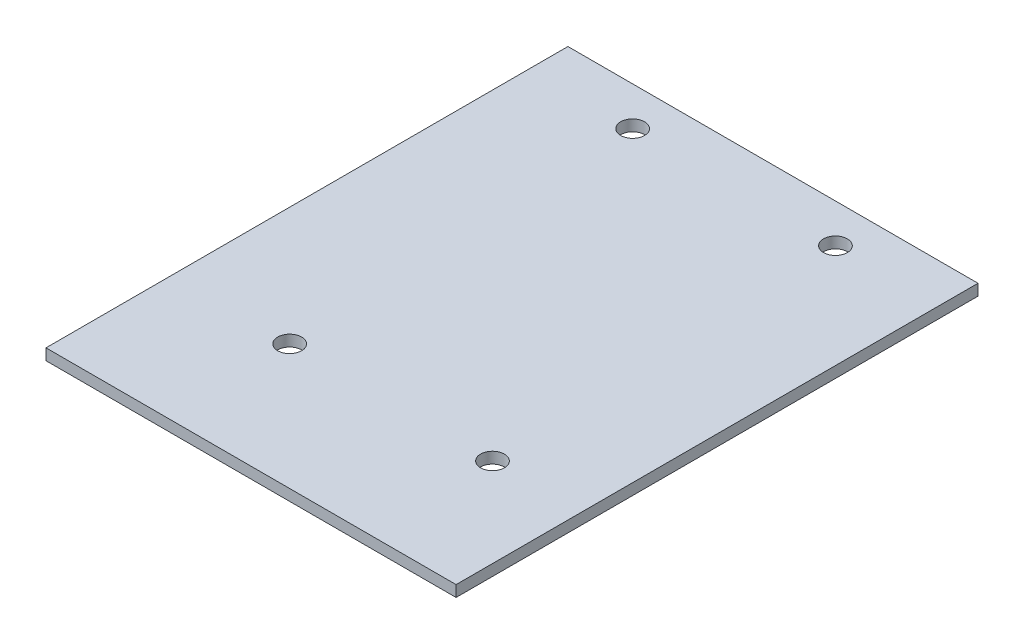
ISO-10303-21;
HEADER;
FILE_DESCRIPTION(('STEP AP214'),'2;1');
FILE_NAME('part.step','',(''),(''),'','','');
FILE_SCHEMA(('AUTOMOTIVE_DESIGN { 1 0 10303 214 1 1 1 1 }'));
ENDSEC;
DATA;
#1=APPLICATION_CONTEXT('core data for automotive mechanical design processes');
#2=APPLICATION_PROTOCOL_DEFINITION('international standard','automotive_design',2000,#1);
#3=PRODUCT_CONTEXT('',#1,'mechanical');
#4=PRODUCT('Part','Part','',(#3));
#5=PRODUCT_RELATED_PRODUCT_CATEGORY('part','',(#4));
#6=PRODUCT_DEFINITION_FORMATION('','',#4);
#7=PRODUCT_DEFINITION_CONTEXT('part definition',#1,'design');
#8=PRODUCT_DEFINITION('design','',#6,#7);
#9=PRODUCT_DEFINITION_SHAPE('','',#8);
#10=(LENGTH_UNIT() NAMED_UNIT(*) SI_UNIT(.MILLI.,.METRE.));
#11=(NAMED_UNIT(*) PLANE_ANGLE_UNIT() SI_UNIT($,.RADIAN.));
#12=(NAMED_UNIT(*) SI_UNIT($,.STERADIAN.) SOLID_ANGLE_UNIT());
#13=UNCERTAINTY_MEASURE_WITH_UNIT(LENGTH_MEASURE(1.E-05),#10,'distance_accuracy_value','');
#14=(GEOMETRIC_REPRESENTATION_CONTEXT(3) GLOBAL_UNCERTAINTY_ASSIGNED_CONTEXT((#13)) GLOBAL_UNIT_ASSIGNED_CONTEXT((#10,
#11,#12)) REPRESENTATION_CONTEXT('',''));
#15=CARTESIAN_POINT('',(0.,0.,0.));
#16=DIRECTION('',(0.,0.,1.));
#17=DIRECTION('',(1.,0.,0.));
#18=AXIS2_PLACEMENT_3D('',#15,#16,#17);
#19=CARTESIAN_POINT('',(0.,1.5,0.));
#20=DIRECTION('',(1.,0.,0.));
#21=DIRECTION('',(0.,0.,-1.));
#22=AXIS2_PLACEMENT_3D('',#19,#20,#21);
#23=PLANE('',#22);
#24=DIRECTION('',(0.,0.,1.));
#25=VECTOR('',#24,1.);
#26=CARTESIAN_POINT('',(0.,0.,0.));
#27=LINE('',#26,#25);
#28=CARTESIAN_POINT('',(0.,0.,-70.));
#29=VERTEX_POINT('',#28);
#30=CARTESIAN_POINT('',(0.,0.,0.));
#31=VERTEX_POINT('',#30);
#32=EDGE_CURVE('E96',#29,#31,#27,.T.);
#33=ORIENTED_EDGE('',*,*,#32,.T.);
#34=DIRECTION('',(0.,-1.,0.));
#35=VECTOR('',#34,1.);
#36=CARTESIAN_POINT('',(0.,1.5,0.));
#37=LINE('',#36,#35);
#38=CARTESIAN_POINT('',(0.,1.5,0.));
#39=VERTEX_POINT('',#38);
#40=EDGE_CURVE('E11',#39,#31,#37,.T.);
#41=ORIENTED_EDGE('',*,*,#40,.F.);
#42=DIRECTION('',(0.,0.,1.));
#43=VECTOR('',#42,1.);
#44=CARTESIAN_POINT('',(0.,1.5,0.));
#45=LINE('',#44,#43);
#46=CARTESIAN_POINT('',(0.,1.5,-70.));
#47=VERTEX_POINT('',#46);
#48=EDGE_CURVE('E84',#47,#39,#45,.T.);
#49=ORIENTED_EDGE('',*,*,#48,.F.);
#50=DIRECTION('',(0.,-1.,0.));
#51=VECTOR('',#50,1.);
#52=CARTESIAN_POINT('',(0.,1.5,-70.));
#53=LINE('',#52,#51);
#54=EDGE_CURVE('E92',#47,#29,#53,.T.);
#55=ORIENTED_EDGE('',*,*,#54,.T.);
#56=EDGE_LOOP('',(#33,#41,#49,#55));
#57=FACE_BOUND('',#56,.T.);
#58=ADVANCED_FACE('F33',(#57),#23,.F.);
#59=CARTESIAN_POINT('',(0.,1.5,0.));
#60=DIRECTION('',(0.,0.,-1.));
#61=DIRECTION('',(-1.,0.,0.));
#62=AXIS2_PLACEMENT_3D('',#59,#60,#61);
#63=PLANE('',#62);
#64=DIRECTION('',(1.,0.,0.));
#65=VECTOR('',#64,1.);
#66=CARTESIAN_POINT('',(0.,0.,0.));
#67=LINE('',#66,#65);
#68=CARTESIAN_POINT('',(55.,0.,0.));
#69=VERTEX_POINT('',#68);
#70=EDGE_CURVE('E88',#31,#69,#67,.T.);
#71=ORIENTED_EDGE('',*,*,#70,.T.);
#72=DIRECTION('',(0.,-1.,0.));
#73=VECTOR('',#72,1.);
#74=CARTESIAN_POINT('',(55.,1.5,0.));
#75=LINE('',#74,#73);
#76=CARTESIAN_POINT('',(55.,1.5,0.));
#77=VERTEX_POINT('',#76);
#78=EDGE_CURVE('E41',#77,#69,#75,.T.);
#79=ORIENTED_EDGE('',*,*,#78,.F.);
#80=DIRECTION('',(1.,0.,0.));
#81=VECTOR('',#80,1.);
#82=CARTESIAN_POINT('',(0.,1.5,0.));
#83=LINE('',#82,#81);
#84=EDGE_CURVE('E79',#39,#77,#83,.T.);
#85=ORIENTED_EDGE('',*,*,#84,.F.);
#86=ORIENTED_EDGE('',*,*,#40,.T.);
#87=EDGE_LOOP('',(#71,#79,#85,#86));
#88=FACE_BOUND('',#87,.T.);
#89=ADVANCED_FACE('F87',(#88),#63,.F.);
#90=CARTESIAN_POINT('',(55.,1.5,0.));
#91=DIRECTION('',(-1.,0.,0.));
#92=DIRECTION('',(0.,0.,1.));
#93=AXIS2_PLACEMENT_3D('',#90,#91,#92);
#94=PLANE('',#93);
#95=DIRECTION('',(0.,0.,-1.));
#96=VECTOR('',#95,1.);
#97=CARTESIAN_POINT('',(55.,0.,0.));
#98=LINE('',#97,#96);
#99=CARTESIAN_POINT('',(55.,0.,-70.));
#100=VERTEX_POINT('',#99);
#101=EDGE_CURVE('E66',#69,#100,#98,.T.);
#102=ORIENTED_EDGE('',*,*,#101,.T.);
#103=DIRECTION('',(0.,-1.,0.));
#104=VECTOR('',#103,1.);
#105=CARTESIAN_POINT('',(55.,1.5,-70.));
#106=LINE('',#105,#104);
#107=CARTESIAN_POINT('',(55.,1.5,-70.));
#108=VERTEX_POINT('',#107);
#109=EDGE_CURVE('E89',#108,#100,#106,.T.);
#110=ORIENTED_EDGE('',*,*,#109,.F.);
#111=DIRECTION('',(0.,0.,-1.));
#112=VECTOR('',#111,1.);
#113=CARTESIAN_POINT('',(55.,1.5,0.));
#114=LINE('',#113,#112);
#115=EDGE_CURVE('E82',#77,#108,#114,.T.);
#116=ORIENTED_EDGE('',*,*,#115,.F.);
#117=ORIENTED_EDGE('',*,*,#78,.T.);
#118=EDGE_LOOP('',(#102,#110,#116,#117));
#119=FACE_BOUND('',#118,.T.);
#120=ADVANCED_FACE('F90',(#119),#94,.F.);
#121=CARTESIAN_POINT('',(0.,1.5,-70.));
#122=DIRECTION('',(0.,0.,1.));
#123=DIRECTION('',(1.,0.,0.));
#124=AXIS2_PLACEMENT_3D('',#121,#122,#123);
#125=PLANE('',#124);
#126=DIRECTION('',(-1.,0.,0.));
#127=VECTOR('',#126,1.);
#128=CARTESIAN_POINT('',(0.,0.,-70.));
#129=LINE('',#128,#127);
#130=EDGE_CURVE('E72',#100,#29,#129,.T.);
#131=ORIENTED_EDGE('',*,*,#130,.T.);
#132=ORIENTED_EDGE('',*,*,#54,.F.);
#133=DIRECTION('',(-1.,0.,0.));
#134=VECTOR('',#133,1.);
#135=CARTESIAN_POINT('',(0.,1.5,-70.));
#136=LINE('',#135,#134);
#137=EDGE_CURVE('E49',#108,#47,#136,.T.);
#138=ORIENTED_EDGE('',*,*,#137,.F.);
#139=ORIENTED_EDGE('',*,*,#109,.T.);
#140=EDGE_LOOP('',(#131,#132,#138,#139));
#141=FACE_BOUND('',#140,.T.);
#142=ADVANCED_FACE('F104',(#141),#125,.F.);
#143=CARTESIAN_POINT('',(0.,1.5,0.));
#144=DIRECTION('',(0.,-1.,0.));
#145=DIRECTION('',(0.,0.,-1.));
#146=AXIS2_PLACEMENT_3D('',#143,#144,#145);
#147=PLANE('',#146);
#148=CARTESIAN_POINT('',(41.0808009190515,1.5,-64.8));
#149=DIRECTION('',(0.,1.,0.));
#150=DIRECTION('',(0.,0.,1.));
#151=AXIS2_PLACEMENT_3D('',#148,#149,#150);
#152=CIRCLE('',#151,1.6);
#153=CARTESIAN_POINT('',(41.0808009190515,1.5,-63.2));
#154=VERTEX_POINT('',#153);
#155=EDGE_CURVE('E119',#154,#154,#152,.T.);
#156=ORIENTED_EDGE('',*,*,#155,.F.);
#157=EDGE_LOOP('',(#156));
#158=FACE_BOUND('',#157,.T.);
#159=CARTESIAN_POINT('',(15.8808009190515,1.5,-16.8));
#160=DIRECTION('',(0.,1.,0.));
#161=DIRECTION('',(0.,0.,1.));
#162=AXIS2_PLACEMENT_3D('',#159,#160,#161);
#163=CIRCLE('',#162,1.6);
#164=CARTESIAN_POINT('',(15.8808009190515,1.5,-15.2));
#165=VERTEX_POINT('',#164);
#166=EDGE_CURVE('E120',#165,#165,#163,.T.);
#167=ORIENTED_EDGE('',*,*,#166,.F.);
#168=EDGE_LOOP('',(#167));
#169=FACE_BOUND('',#168,.T.);
#170=CARTESIAN_POINT('',(43.0808009190515,1.5,-16.8));
#171=DIRECTION('',(0.,1.,0.));
#172=DIRECTION('',(0.,0.,1.));
#173=AXIS2_PLACEMENT_3D('',#170,#171,#172);
#174=CIRCLE('',#173,1.6);
#175=CARTESIAN_POINT('',(43.0808009190515,1.5,-15.2));
#176=VERTEX_POINT('',#175);
#177=EDGE_CURVE('E130',#176,#176,#174,.T.);
#178=ORIENTED_EDGE('',*,*,#177,.F.);
#179=EDGE_LOOP('',(#178));
#180=FACE_BOUND('',#179,.T.);
#181=CARTESIAN_POINT('',(13.8808009190515,1.5,-64.8));
#182=DIRECTION('',(0.,1.,0.));
#183=DIRECTION('',(0.,0.,1.));
#184=AXIS2_PLACEMENT_3D('',#181,#182,#183);
#185=CIRCLE('',#184,1.6);
#186=CARTESIAN_POINT('',(13.8808009190515,1.5,-63.2));
#187=VERTEX_POINT('',#186);
#188=EDGE_CURVE('E112',#187,#187,#185,.T.);
#189=ORIENTED_EDGE('',*,*,#188,.F.);
#190=EDGE_LOOP('',(#189));
#191=FACE_BOUND('',#190,.T.);
#192=ORIENTED_EDGE('',*,*,#48,.T.);
#193=ORIENTED_EDGE('',*,*,#84,.T.);
#194=ORIENTED_EDGE('',*,*,#115,.T.);
#195=ORIENTED_EDGE('',*,*,#137,.T.);
#196=EDGE_LOOP('',(#192,#193,#194,#195));
#197=FACE_BOUND('',#196,.T.);
#198=ADVANCED_FACE('F80',(#158,#169,#180,#191,#197),#147,.F.);
#199=CARTESIAN_POINT('',(0.,0.,0.));
#200=DIRECTION('',(0.,-1.,0.));
#201=DIRECTION('',(0.,0.,-1.));
#202=AXIS2_PLACEMENT_3D('',#199,#200,#201);
#203=PLANE('',#202);
#204=CARTESIAN_POINT('',(41.0808009190515,0.,-64.8));
#205=DIRECTION('',(0.,-1.,0.));
#206=DIRECTION('',(0.,0.,-1.));
#207=AXIS2_PLACEMENT_3D('',#204,#205,#206);
#208=CIRCLE('',#207,1.6);
#209=CARTESIAN_POINT('',(41.0808009190515,0.,-66.4));
#210=VERTEX_POINT('',#209);
#211=EDGE_CURVE('E115',#210,#210,#208,.F.);
#212=ORIENTED_EDGE('',*,*,#211,.T.);
#213=EDGE_LOOP('',(#212));
#214=FACE_BOUND('',#213,.T.);
#215=CARTESIAN_POINT('',(15.8808009190515,0.,-16.8));
#216=DIRECTION('',(0.,-1.,0.));
#217=DIRECTION('',(0.,0.,-1.));
#218=AXIS2_PLACEMENT_3D('',#215,#216,#217);
#219=CIRCLE('',#218,1.6);
#220=CARTESIAN_POINT('',(15.8808009190515,0.,-18.4));
#221=VERTEX_POINT('',#220);
#222=EDGE_CURVE('E116',#221,#221,#219,.F.);
#223=ORIENTED_EDGE('',*,*,#222,.T.);
#224=EDGE_LOOP('',(#223));
#225=FACE_BOUND('',#224,.T.);
#226=CARTESIAN_POINT('',(43.0808009190515,0.,-16.8));
#227=DIRECTION('',(0.,-1.,0.));
#228=DIRECTION('',(0.,0.,-1.));
#229=AXIS2_PLACEMENT_3D('',#226,#227,#228);
#230=CIRCLE('',#229,1.6);
#231=CARTESIAN_POINT('',(43.0808009190515,0.,-18.4));
#232=VERTEX_POINT('',#231);
#233=EDGE_CURVE('E123',#232,#232,#230,.F.);
#234=ORIENTED_EDGE('',*,*,#233,.T.);
#235=EDGE_LOOP('',(#234));
#236=FACE_BOUND('',#235,.T.);
#237=CARTESIAN_POINT('',(13.8808009190515,0.,-64.8));
#238=DIRECTION('',(0.,-1.,0.));
#239=DIRECTION('',(0.,0.,-1.));
#240=AXIS2_PLACEMENT_3D('',#237,#238,#239);
#241=CIRCLE('',#240,1.6);
#242=CARTESIAN_POINT('',(13.8808009190515,0.,-66.4));
#243=VERTEX_POINT('',#242);
#244=EDGE_CURVE('E99',#243,#243,#241,.F.);
#245=ORIENTED_EDGE('',*,*,#244,.T.);
#246=EDGE_LOOP('',(#245));
#247=FACE_BOUND('',#246,.T.);
#248=ORIENTED_EDGE('',*,*,#32,.F.);
#249=ORIENTED_EDGE('',*,*,#130,.F.);
#250=ORIENTED_EDGE('',*,*,#101,.F.);
#251=ORIENTED_EDGE('',*,*,#70,.F.);
#252=EDGE_LOOP('',(#248,#249,#250,#251));
#253=FACE_BOUND('',#252,.T.);
#254=ADVANCED_FACE('F107',(#214,#225,#236,#247,#253),#203,.T.);
#255=CARTESIAN_POINT('',(13.8808009190515,-4.52548339959391,-64.8));
#256=DIRECTION('',(0.,1.,0.));
#257=DIRECTION('',(0.,0.,1.));
#258=AXIS2_PLACEMENT_3D('',#255,#256,#257);
#259=CYLINDRICAL_SURFACE('',#258,1.6);
#260=ORIENTED_EDGE('',*,*,#188,.T.);
#261=EDGE_LOOP('',(#260));
#262=FACE_BOUND('',#261,.T.);
#263=ORIENTED_EDGE('',*,*,#244,.F.);
#264=EDGE_LOOP('',(#263));
#265=FACE_BOUND('',#264,.T.);
#266=ADVANCED_FACE('F143',(#262,#265),#259,.F.);
#267=CARTESIAN_POINT('',(43.0808009190515,-4.52548339959391,-16.8));
#268=DIRECTION('',(0.,1.,0.));
#269=DIRECTION('',(0.,0.,1.));
#270=AXIS2_PLACEMENT_3D('',#267,#268,#269);
#271=CYLINDRICAL_SURFACE('',#270,1.6);
#272=ORIENTED_EDGE('',*,*,#177,.T.);
#273=EDGE_LOOP('',(#272));
#274=FACE_BOUND('',#273,.T.);
#275=ORIENTED_EDGE('',*,*,#233,.F.);
#276=EDGE_LOOP('',(#275));
#277=FACE_BOUND('',#276,.T.);
#278=ADVANCED_FACE('F134',(#274,#277),#271,.F.);
#279=CARTESIAN_POINT('',(15.8808009190515,-4.52548339959391,-16.8));
#280=DIRECTION('',(0.,1.,0.));
#281=DIRECTION('',(0.,0.,1.));
#282=AXIS2_PLACEMENT_3D('',#279,#280,#281);
#283=CYLINDRICAL_SURFACE('',#282,1.6);
#284=ORIENTED_EDGE('',*,*,#166,.T.);
#285=EDGE_LOOP('',(#284));
#286=FACE_BOUND('',#285,.T.);
#287=ORIENTED_EDGE('',*,*,#222,.F.);
#288=EDGE_LOOP('',(#287));
#289=FACE_BOUND('',#288,.T.);
#290=ADVANCED_FACE('F192',(#286,#289),#283,.F.);
#291=CARTESIAN_POINT('',(41.0808009190515,-4.52548339959391,-64.8));
#292=DIRECTION('',(0.,1.,0.));
#293=DIRECTION('',(0.,0.,1.));
#294=AXIS2_PLACEMENT_3D('',#291,#292,#293);
#295=CYLINDRICAL_SURFACE('',#294,1.6);
#296=ORIENTED_EDGE('',*,*,#155,.T.);
#297=EDGE_LOOP('',(#296));
#298=FACE_BOUND('',#297,.T.);
#299=ORIENTED_EDGE('',*,*,#211,.F.);
#300=EDGE_LOOP('',(#299));
#301=FACE_BOUND('',#300,.T.);
#302=ADVANCED_FACE('F201',(#298,#301),#295,.F.);
#303=CLOSED_SHELL('',(#58,#89,#120,#142,#198,#254,#266,#278,#290,#302));
#304=MANIFOLD_SOLID_BREP('B2',#303);
#305=ADVANCED_BREP_SHAPE_REPRESENTATION('',(#18,#304),#14);
#306=SHAPE_DEFINITION_REPRESENTATION(#9,#305);
ENDSEC;
END-ISO-10303-21;
